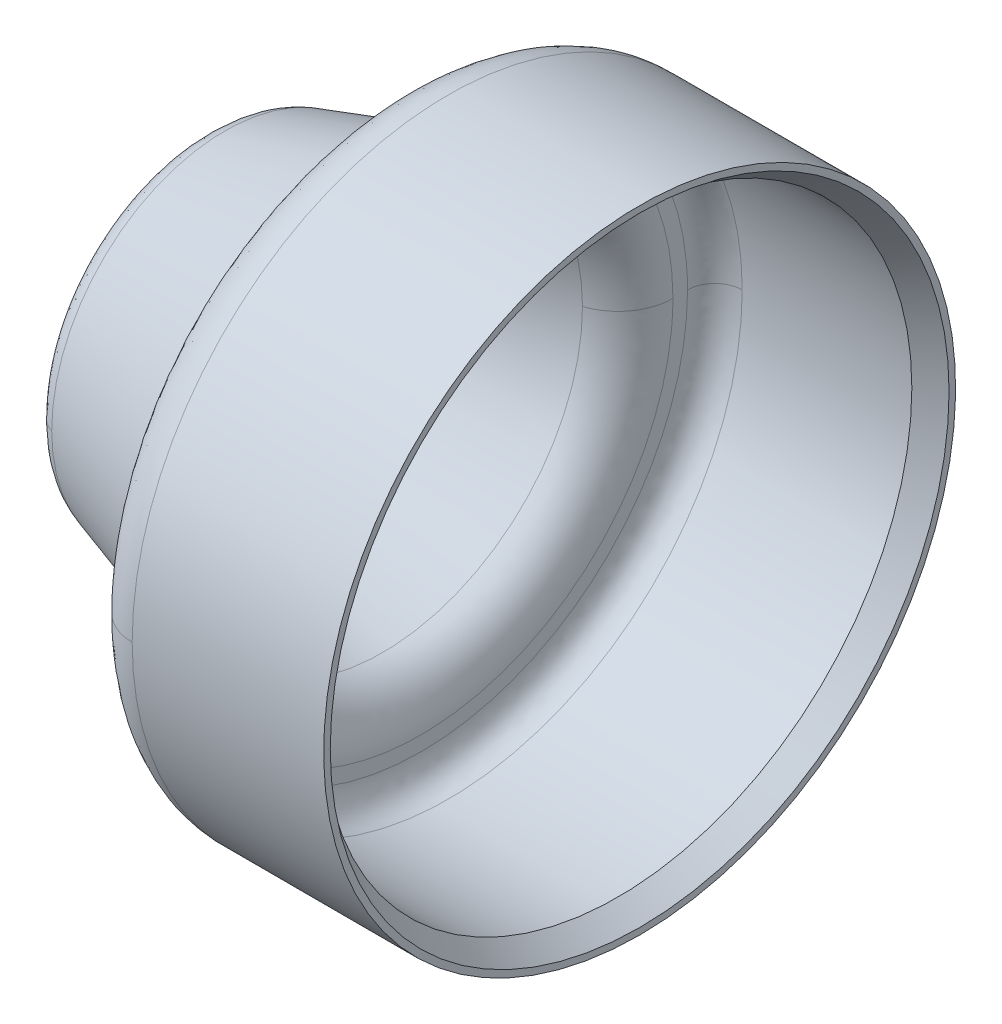
ISO-10303-21;
HEADER;
FILE_DESCRIPTION(('STEP AP214'),'2;1');
FILE_NAME('part.step','',(''),(''),'','','');
FILE_SCHEMA(('AUTOMOTIVE_DESIGN { 1 0 10303 214 1 1 1 1 }'));
ENDSEC;
DATA;
#1=APPLICATION_CONTEXT('core data for automotive mechanical design processes');
#2=APPLICATION_PROTOCOL_DEFINITION('international standard','automotive_design',2000,#1);
#3=PRODUCT_CONTEXT('',#1,'mechanical');
#4=PRODUCT('Part','Part','',(#3));
#5=PRODUCT_RELATED_PRODUCT_CATEGORY('part','',(#4));
#6=PRODUCT_DEFINITION_FORMATION('','',#4);
#7=PRODUCT_DEFINITION_CONTEXT('part definition',#1,'design');
#8=PRODUCT_DEFINITION('design','',#6,#7);
#9=PRODUCT_DEFINITION_SHAPE('','',#8);
#10=(LENGTH_UNIT() NAMED_UNIT(*) SI_UNIT(.MILLI.,.METRE.));
#11=(NAMED_UNIT(*) PLANE_ANGLE_UNIT() SI_UNIT($,.RADIAN.));
#12=(NAMED_UNIT(*) SI_UNIT($,.STERADIAN.) SOLID_ANGLE_UNIT());
#13=UNCERTAINTY_MEASURE_WITH_UNIT(LENGTH_MEASURE(1.E-05),#10,'distance_accuracy_value','');
#14=(GEOMETRIC_REPRESENTATION_CONTEXT(3) GLOBAL_UNCERTAINTY_ASSIGNED_CONTEXT((#13)) GLOBAL_UNIT_ASSIGNED_CONTEXT((#10,
#11,#12)) REPRESENTATION_CONTEXT('',''));
#15=CARTESIAN_POINT('',(0.,0.,0.));
#16=DIRECTION('',(0.,0.,1.));
#17=DIRECTION('',(1.,0.,0.));
#18=AXIS2_PLACEMENT_3D('',#15,#16,#17);
#19=CARTESIAN_POINT('',(0.,-2.624397632,2.624397632));
#20=DIRECTION('',(-1.,0.,0.));
#21=DIRECTION('',(0.,1.,0.));
#22=AXIS2_PLACEMENT_3D('',#19,#20,#21);
#23=PLANE('',#22);
#24=CARTESIAN_POINT('',(4.44899655361946E-11,0.,2.59327829228685));
#25=CARTESIAN_POINT('',(4.44899632741889E-11,5.18655658538515,2.59327829228685));
#26=CARTESIAN_POINT('',(4.44899632741889E-11,5.18655658538515,-2.59327829228685));
#27=CARTESIAN_POINT('',(4.44899655361946E-11,0.,-2.59327829228685));
#28=(BOUNDED_CURVE() B_SPLINE_CURVE(3,(#24,#25,#26,#27),.UNSPECIFIED.,.F.,
.F.) B_SPLINE_CURVE_WITH_KNOTS((4,4),(0.,1.),
.UNSPECIFIED.) CURVE() GEOMETRIC_REPRESENTATION_ITEM() RATIONAL_B_SPLINE_CURVE((0.965090916232168,
0.321696972077389,0.321696972077389,0.965090916232168)) REPRESENTATION_ITEM(''));
#29=CARTESIAN_POINT('',(2.6693979149664E-11,0.,-2.5932782918945));
#30=VERTEX_POINT('',#29);
#31=CARTESIAN_POINT('',(2.66939791828542E-11,0.,2.5932782918945));
#32=VERTEX_POINT('',#31);
#33=EDGE_CURVE('E101',#30,#32,#28,.F.);
#34=ORIENTED_EDGE('',*,*,#33,.T.);
#35=CARTESIAN_POINT('',(4.44899655361946E-11,0.,-2.59327829228685));
#36=CARTESIAN_POINT('',(4.44899632741889E-11,-5.18655658538515,-2.59327829228685));
#37=CARTESIAN_POINT('',(4.44899632741889E-11,-5.18655658538515,2.59327829228685));
#38=CARTESIAN_POINT('',(4.44899655361946E-11,0.,2.59327829228685));
#39=(BOUNDED_CURVE() B_SPLINE_CURVE(3,(#35,#36,#37,#38),.UNSPECIFIED.,.F.,
.F.) B_SPLINE_CURVE_WITH_KNOTS((4,4),(0.,1.),
.UNSPECIFIED.) CURVE() GEOMETRIC_REPRESENTATION_ITEM() RATIONAL_B_SPLINE_CURVE((0.965090916232168,
0.321696972077389,0.321696972077389,0.965090916232168)) REPRESENTATION_ITEM(''));
#40=EDGE_CURVE('E105',#32,#30,#39,.F.);
#41=ORIENTED_EDGE('',*,*,#40,.T.);
#42=EDGE_LOOP('',(#34,#41));
#43=FACE_BOUND('',#42,.T.);
#44=ADVANCED_FACE('F16',(#43),#23,.F.);
#45=CARTESIAN_POINT('',(0.000999167000000001,0.,2.573311609));
#46=CARTESIAN_POINT('',(0.000999167000000001,5.146623219,2.573311609));
#47=CARTESIAN_POINT('',(0.000999167000000001,5.146623219,-2.573311609));
#48=CARTESIAN_POINT('',(0.000999167000000001,0.,-2.573311609));
#49=CARTESIAN_POINT('',(-0.009741712,0.,2.680362131));
#50=CARTESIAN_POINT('',(-0.009741712,5.360724262,2.680362131));
#51=CARTESIAN_POINT('',(-0.009741712,5.360724262,-2.680362131));
#52=CARTESIAN_POINT('',(-0.009741712,0.,-2.680362131));
#53=CARTESIAN_POINT('',(0.053876118,0.,2.767125904));
#54=CARTESIAN_POINT('',(0.053876118,5.534251807,2.767125904));
#55=CARTESIAN_POINT('',(0.053876118,5.534251807,-2.767125904));
#56=CARTESIAN_POINT('',(0.053876118,0.,-2.767125904));
#57=CARTESIAN_POINT('',(0.15920186,0.,2.789072858));
#58=CARTESIAN_POINT('',(0.15920186,5.578145716,2.789072858));
#59=CARTESIAN_POINT('',(0.15920186,5.578145716,-2.789072858));
#60=CARTESIAN_POINT('',(0.15920186,0.,-2.789072858));
#61=(BOUNDED_SURFACE() B_SPLINE_SURFACE(3,3,((#45,#46,#47,#48),(#49,#50,#51,#52),(#53,#54,#55,
#56),(#57,#58,#59,#60)),.UNSPECIFIED.,.F.,.F.,.F.) B_SPLINE_SURFACE_WITH_KNOTS((4,4),(4,4),(0.,
1.),(0.,1.),.UNSPECIFIED.) GEOMETRIC_REPRESENTATION_ITEM() RATIONAL_B_SPLINE_SURFACE(((1.,
0.333333333333333,0.333333333333333,1.),(0.828922185213233,0.276307395071078,0.276307395071078,
0.828922185213233),(0.828922185213233,0.276307395071078,0.276307395071078,0.828922185213233),
(1.,0.333333333333333,0.333333333333333,1.))) REPRESENTATION_ITEM('') SURFACE());
#62=CARTESIAN_POINT('',(0.139858840000007,0.,0.));
#63=DIRECTION('',(1.,0.,0.));
#64=DIRECTION('',(0.,0.,-1.));
#65=AXIS2_PLACEMENT_3D('',#62,#63,#64);
#66=CIRCLE('',#65,2.784021683);
#67=CARTESIAN_POINT('',(0.139858840054538,-8.56518588366484E-10,2.78402168300261));
#68=VERTEX_POINT('',#67);
#69=CARTESIAN_POINT('',(0.139858840054538,-3.74981112811257E-10,-2.78402168300262));
#70=VERTEX_POINT('',#69);
#71=EDGE_CURVE('E125',#68,#70,#66,.F.);
#72=CARTESIAN_POINT('',(0.000999167000000001,0.,2.573311609));
#73=CARTESIAN_POINT('',(-0.009741712,0.,2.680362131));
#74=CARTESIAN_POINT('',(0.053876118,0.,2.767125904));
#75=CARTESIAN_POINT('',(0.15920186,0.,2.789072858));
#76=(BOUNDED_CURVE() B_SPLINE_CURVE(3,(#72,#73,#74,#75),.UNSPECIFIED.,.F.,
.F.) B_SPLINE_CURVE_WITH_KNOTS((4,4),(0.,1.),
.UNSPECIFIED.) CURVE() GEOMETRIC_REPRESENTATION_ITEM() RATIONAL_B_SPLINE_CURVE((1.,
0.828922185213233,0.828922185213233,1.)) REPRESENTATION_ITEM(''));
#77=EDGE_CURVE('E112',#68,#32,#76,.F.);
#78=CARTESIAN_POINT('',(0.000999167000000001,0.,-2.573311609));
#79=CARTESIAN_POINT('',(-0.009741712,0.,-2.680362131));
#80=CARTESIAN_POINT('',(0.053876118,0.,-2.767125904));
#81=CARTESIAN_POINT('',(0.15920186,0.,-2.789072858));
#82=(BOUNDED_CURVE() B_SPLINE_CURVE(3,(#78,#79,#80,#81),.UNSPECIFIED.,.F.,
.F.) B_SPLINE_CURVE_WITH_KNOTS((4,4),(0.,1.),
.UNSPECIFIED.) CURVE() GEOMETRIC_REPRESENTATION_ITEM() RATIONAL_B_SPLINE_CURVE((1.,
0.828922185213233,0.828922185213233,1.)) REPRESENTATION_ITEM(''));
#83=EDGE_CURVE('E111',#30,#70,#82,.T.);
#84=ORIENTED_EDGE('',*,*,#71,.F.);
#85=ORIENTED_EDGE('',*,*,#77,.T.);
#86=ORIENTED_EDGE('',*,*,#33,.F.);
#87=ORIENTED_EDGE('',*,*,#83,.T.);
#88=EDGE_LOOP('',(#84,#85,#86,#87));
#89=FACE_BOUND('',#88,.T.);
#90=ADVANCED_FACE('F117',(#89),#61,.F.);
#91=CARTESIAN_POINT('',(0.000999167000000001,0.,-2.573311609));
#92=CARTESIAN_POINT('',(0.000999167000000001,-5.146623219,-2.573311609));
#93=CARTESIAN_POINT('',(0.000999167000000001,-5.146623219,2.573311609));
#94=CARTESIAN_POINT('',(0.000999167000000001,0.,2.573311609));
#95=CARTESIAN_POINT('',(-0.009741712,0.,-2.680362131));
#96=CARTESIAN_POINT('',(-0.009741712,-5.360724262,-2.680362131));
#97=CARTESIAN_POINT('',(-0.009741712,-5.360724262,2.680362131));
#98=CARTESIAN_POINT('',(-0.009741712,0.,2.680362131));
#99=CARTESIAN_POINT('',(0.053876118,0.,-2.767125904));
#100=CARTESIAN_POINT('',(0.053876118,-5.534251807,-2.767125904));
#101=CARTESIAN_POINT('',(0.053876118,-5.534251807,2.767125904));
#102=CARTESIAN_POINT('',(0.053876118,0.,2.767125904));
#103=CARTESIAN_POINT('',(0.15920186,0.,-2.789072858));
#104=CARTESIAN_POINT('',(0.15920186,-5.578145716,-2.789072858));
#105=CARTESIAN_POINT('',(0.15920186,-5.578145716,2.789072858));
#106=CARTESIAN_POINT('',(0.15920186,0.,2.789072858));
#107=(BOUNDED_SURFACE() B_SPLINE_SURFACE(3,3,((#91,#92,#93,#94),(#95,#96,#97,#98),(#99,#100,
#101,#102),(#103,#104,#105,#106)),.UNSPECIFIED.,.F.,.F.,.F.) B_SPLINE_SURFACE_WITH_KNOTS((4,4),
(4,4),(0.,1.),(0.,1.),
.UNSPECIFIED.) GEOMETRIC_REPRESENTATION_ITEM() RATIONAL_B_SPLINE_SURFACE(((1.,0.333333333333333,
0.333333333333333,1.),(0.828922185213233,0.276307395071078,0.276307395071078,0.828922185213233),
(0.828922185213233,0.276307395071078,0.276307395071078,0.828922185213233),(1.,0.333333333333333,
0.333333333333333,1.))) REPRESENTATION_ITEM('') SURFACE());
#108=CARTESIAN_POINT('',(0.139858840000007,0.,0.));
#109=DIRECTION('',(1.,0.,0.));
#110=DIRECTION('',(0.,0.,-1.));
#111=AXIS2_PLACEMENT_3D('',#108,#109,#110);
#112=CIRCLE('',#111,2.784021683);
#113=EDGE_CURVE('E123',#70,#68,#112,.F.);
#114=ORIENTED_EDGE('',*,*,#83,.F.);
#115=ORIENTED_EDGE('',*,*,#40,.F.);
#116=ORIENTED_EDGE('',*,*,#77,.F.);
#117=ORIENTED_EDGE('',*,*,#113,.F.);
#118=EDGE_LOOP('',(#114,#115,#116,#117));
#119=FACE_BOUND('',#118,.T.);
#120=ADVANCED_FACE('F121',(#119),#107,.F.);
#121=CARTESIAN_POINT('',(0.13985884,0.,0.));
#122=DIRECTION('',(1.,0.,0.));
#123=DIRECTION('',(0.,0.,-1.));
#124=AXIS2_PLACEMENT_3D('',#121,#122,#123);
#125=CONICAL_SURFACE('',#124,2.784021683,0.305432619175368);
#126=CARTESIAN_POINT('',(2.90070579940886,0.,0.));
#127=DIRECTION('',(-1.,0.,0.));
#128=DIRECTION('',(0.,-1.,0.));
#129=AXIS2_PLACEMENT_3D('',#126,#127,#128);
#130=CIRCLE('',#129,3.65451338528454);
#131=CARTESIAN_POINT('',(2.90070579955662,-3.74776612511883E-10,3.6545133854634));
#132=VERTEX_POINT('',#131);
#133=CARTESIAN_POINT('',(2.90070579937093,-1.64076008524642E-10,-3.65451338540485));
#134=VERTEX_POINT('',#133);
#135=EDGE_CURVE('E567',#132,#134,#130,.T.);
#136=ORIENTED_EDGE('',*,*,#135,.F.);
#137=CARTESIAN_POINT('',(2.90070579940886,0.,0.));
#138=DIRECTION('',(-1.,0.,0.));
#139=DIRECTION('',(0.,-1.,0.));
#140=AXIS2_PLACEMENT_3D('',#137,#138,#139);
#141=CIRCLE('',#140,3.65451338528454);
#142=EDGE_CURVE('E577',#134,#132,#141,.T.);
#143=ORIENTED_EDGE('',*,*,#142,.F.);
#144=EDGE_LOOP('',(#136,#143));
#145=FACE_BOUND('',#144,.T.);
#146=ORIENTED_EDGE('',*,*,#113,.T.);
#147=ORIENTED_EDGE('',*,*,#71,.T.);
#148=EDGE_LOOP('',(#146,#147));
#149=FACE_BOUND('',#148,.T.);
#150=ADVANCED_FACE('F160',(#145,#149),#125,.F.);
#151=CARTESIAN_POINT('',(-0.4,-2.624397632,2.624397632));
#152=DIRECTION('',(-1.,0.,0.));
#153=DIRECTION('',(0.,1.,0.));
#154=AXIS2_PLACEMENT_3D('',#151,#152,#153);
#155=PLANE('',#154);
#156=CARTESIAN_POINT('',(-0.399999999854075,0.,2.59327829310577));
#157=CARTESIAN_POINT('',(-0.399999999854075,-5.18655658622481,2.59327829310577));
#158=CARTESIAN_POINT('',(-0.399999999854075,-5.18655658622481,-2.59327829310577));
#159=CARTESIAN_POINT('',(-0.399999999854075,0.,-2.59327829310577));
#160=(BOUNDED_CURVE() B_SPLINE_CURVE(3,(#156,#157,#158,#159),.UNSPECIFIED.,.F.,
.F.) B_SPLINE_CURVE_WITH_KNOTS((4,4),(0.,1.),
.UNSPECIFIED.) CURVE() GEOMETRIC_REPRESENTATION_ITEM() RATIONAL_B_SPLINE_CURVE((0.965090915911284,
0.321696971970428,0.321696971970428,0.965090915911284)) REPRESENTATION_ITEM(''));
#161=CARTESIAN_POINT('',(-0.399999999912445,0.,2.59327829234567));
#162=VERTEX_POINT('',#161);
#163=CARTESIAN_POINT('',(-0.399999999912445,0.,-2.59327829234567));
#164=VERTEX_POINT('',#163);
#165=EDGE_CURVE('E209',#162,#164,#160,.T.);
#166=ORIENTED_EDGE('',*,*,#165,.F.);
#167=CARTESIAN_POINT('',(-0.399999999854075,0.,-2.59327829310576));
#168=CARTESIAN_POINT('',(-0.399999999854075,5.18655658622481,-2.59327829310576));
#169=CARTESIAN_POINT('',(-0.399999999854075,5.18655658622481,2.59327829310576));
#170=CARTESIAN_POINT('',(-0.399999999854075,0.,2.59327829310576));
#171=(BOUNDED_CURVE() B_SPLINE_CURVE(3,(#167,#168,#169,#170),.UNSPECIFIED.,.F.,
.F.) B_SPLINE_CURVE_WITH_KNOTS((4,4),(0.,1.),
.UNSPECIFIED.) CURVE() GEOMETRIC_REPRESENTATION_ITEM() RATIONAL_B_SPLINE_CURVE((0.965090915911282,
0.321696971970427,0.321696971970427,0.965090915911282)) REPRESENTATION_ITEM(''));
#172=EDGE_CURVE('E221',#164,#162,#171,.T.);
#173=ORIENTED_EDGE('',*,*,#172,.F.);
#174=EDGE_LOOP('',(#166,#173));
#175=FACE_BOUND('',#174,.T.);
#176=ADVANCED_FACE('F194',(#175),#155,.T.);
#177=CARTESIAN_POINT('',(3.595004165,0.,4.708063753));
#178=CARTESIAN_POINT('',(3.595004165,9.416127506,4.708063753));
#179=CARTESIAN_POINT('',(3.595004165,9.416127506,-4.708063753));
#180=CARTESIAN_POINT('',(3.595004165,0.,-4.708063753));
#181=CARTESIAN_POINT('',(3.64870856,0.,4.172811146));
#182=CARTESIAN_POINT('',(3.64870856,8.345622292,4.172811146));
#183=CARTESIAN_POINT('',(3.64870856,8.345622292,-4.172811146));
#184=CARTESIAN_POINT('',(3.64870856,0.,-4.172811146));
#185=CARTESIAN_POINT('',(3.330619408,0.,3.738992282));
#186=CARTESIAN_POINT('',(3.330619408,7.477984564,3.738992282));
#187=CARTESIAN_POINT('',(3.330619408,7.477984564,-3.738992282));
#188=CARTESIAN_POINT('',(3.330619408,0.,-3.738992282));
#189=CARTESIAN_POINT('',(2.803990701,0.,3.62925751));
#190=CARTESIAN_POINT('',(2.803990701,7.258515021,3.62925751));
#191=CARTESIAN_POINT('',(2.803990701,7.258515021,-3.62925751));
#192=CARTESIAN_POINT('',(2.803990701,0.,-3.62925751));
#193=(BOUNDED_SURFACE() B_SPLINE_SURFACE(3,3,((#177,#178,#179,#180),(#181,#182,#183,#184),(#185,
#186,#187,#188),(#189,#190,#191,#192)),.UNSPECIFIED.,.F.,.F.,
.F.) B_SPLINE_SURFACE_WITH_KNOTS((4,4),(4,4),(0.,1.),(0.,1.),
.UNSPECIFIED.) GEOMETRIC_REPRESENTATION_ITEM() RATIONAL_B_SPLINE_SURFACE(((1.,0.333333333333333,
0.333333333333333,1.),(0.828922185213162,0.276307395071054,0.276307395071054,0.828922185213162),
(0.828922185213162,0.276307395071054,0.276307395071054,0.828922185213162),(1.,0.333333333333333,
0.333333333333333,1.))) REPRESENTATION_ITEM('') SURFACE());
#194=CARTESIAN_POINT('',(3.59999999975223,0.,-4.60823033608385));
#195=CARTESIAN_POINT('',(3.59999999975223,9.21646067216811,-4.60823033608385));
#196=CARTESIAN_POINT('',(3.59999999975223,9.21646067216811,4.60823033608385));
#197=CARTESIAN_POINT('',(3.59999999975223,0.,4.60823033608385));
#198=(BOUNDED_CURVE() B_SPLINE_CURVE(3,(#194,#195,#196,#197),.UNSPECIFIED.,.F.,
.F.) B_SPLINE_CURVE_WITH_KNOTS((4,4),(0.,1.),
.UNSPECIFIED.) CURVE() GEOMETRIC_REPRESENTATION_ITEM() RATIONAL_B_SPLINE_CURVE((0.965090915909486,
0.321696971969828,0.321696971969828,0.965090915909486)) REPRESENTATION_ITEM(''));
#199=CARTESIAN_POINT('',(3.59999999985134,0.,-4.60823033724953));
#200=VERTEX_POINT('',#199);
#201=CARTESIAN_POINT('',(3.59999999985134,0.,4.60823033724953));
#202=VERTEX_POINT('',#201);
#203=EDGE_CURVE('E235',#200,#202,#198,.T.);
#204=CARTESIAN_POINT('',(3.595004165,0.,4.708063753));
#205=CARTESIAN_POINT('',(3.64870856,0.,4.172811146));
#206=CARTESIAN_POINT('',(3.330619408,0.,3.738992282));
#207=CARTESIAN_POINT('',(2.803990701,0.,3.62925751));
#208=(BOUNDED_CURVE() B_SPLINE_CURVE(3,(#204,#205,#206,#207),.UNSPECIFIED.,.F.,
.F.) B_SPLINE_CURVE_WITH_KNOTS((4,4),(0.,1.),
.UNSPECIFIED.) CURVE() GEOMETRIC_REPRESENTATION_ITEM() RATIONAL_B_SPLINE_CURVE((1.,
0.828922185213183,0.828922185213183,1.)) REPRESENTATION_ITEM(''));
#209=EDGE_CURVE('E580',#132,#202,#208,.F.);
#210=CARTESIAN_POINT('',(3.595004165,0.,-4.708063753));
#211=CARTESIAN_POINT('',(3.64870856,0.,-4.172811146));
#212=CARTESIAN_POINT('',(3.330619408,0.,-3.738992282));
#213=CARTESIAN_POINT('',(2.803990701,0.,-3.62925751));
#214=(BOUNDED_CURVE() B_SPLINE_CURVE(3,(#210,#211,#212,#213),.UNSPECIFIED.,.F.,
.F.) B_SPLINE_CURVE_WITH_KNOTS((4,4),(0.,1.),
.UNSPECIFIED.) CURVE() GEOMETRIC_REPRESENTATION_ITEM() RATIONAL_B_SPLINE_CURVE((1.,
0.828922185213183,0.828922185213183,1.)) REPRESENTATION_ITEM(''));
#215=EDGE_CURVE('E574',#200,#134,#214,.T.);
#216=ORIENTED_EDGE('',*,*,#203,.T.);
#217=ORIENTED_EDGE('',*,*,#209,.F.);
#218=ORIENTED_EDGE('',*,*,#135,.T.);
#219=ORIENTED_EDGE('',*,*,#215,.F.);
#220=EDGE_LOOP('',(#216,#217,#218,#219));
#221=FACE_BOUND('',#220,.T.);
#222=ADVANCED_FACE('F591',(#221),#193,.T.);
#223=CARTESIAN_POINT('',(3.595004165,0.,-4.708063753));
#224=CARTESIAN_POINT('',(3.595004165,-9.416127506,-4.708063753));
#225=CARTESIAN_POINT('',(3.595004165,-9.416127506,4.708063753));
#226=CARTESIAN_POINT('',(3.595004165,0.,4.708063753));
#227=CARTESIAN_POINT('',(3.64870856,0.,-4.172811146));
#228=CARTESIAN_POINT('',(3.64870856,-8.345622292,-4.172811146));
#229=CARTESIAN_POINT('',(3.64870856,-8.345622292,4.172811146));
#230=CARTESIAN_POINT('',(3.64870856,0.,4.172811146));
#231=CARTESIAN_POINT('',(3.330619408,0.,-3.738992282));
#232=CARTESIAN_POINT('',(3.330619408,-7.477984564,-3.738992282));
#233=CARTESIAN_POINT('',(3.330619408,-7.477984564,3.738992282));
#234=CARTESIAN_POINT('',(3.330619408,0.,3.738992282));
#235=CARTESIAN_POINT('',(2.803990701,0.,-3.62925751));
#236=CARTESIAN_POINT('',(2.803990701,-7.258515021,-3.62925751));
#237=CARTESIAN_POINT('',(2.803990701,-7.258515021,3.62925751));
#238=CARTESIAN_POINT('',(2.803990701,0.,3.62925751));
#239=(BOUNDED_SURFACE() B_SPLINE_SURFACE(3,3,((#223,#224,#225,#226),(#227,#228,#229,#230),(#231,
#232,#233,#234),(#235,#236,#237,#238)),.UNSPECIFIED.,.F.,.F.,
.F.) B_SPLINE_SURFACE_WITH_KNOTS((4,4),(4,4),(0.,1.),(0.,1.),
.UNSPECIFIED.) GEOMETRIC_REPRESENTATION_ITEM() RATIONAL_B_SPLINE_SURFACE(((1.,0.333333333333333,
0.333333333333333,1.),(0.828922185213183,0.276307395071061,0.276307395071061,0.828922185213183),
(0.828922185213183,0.276307395071061,0.276307395071061,0.828922185213183),(1.,0.333333333333333,
0.333333333333333,1.))) REPRESENTATION_ITEM('') SURFACE());
#240=CARTESIAN_POINT('',(3.59999999975223,0.,4.60823033608385));
#241=CARTESIAN_POINT('',(3.59999999975223,-9.2164606721681,4.60823033608385));
#242=CARTESIAN_POINT('',(3.59999999975223,-9.2164606721681,-4.60823033608385));
#243=CARTESIAN_POINT('',(3.59999999975223,0.,-4.60823033608385));
#244=(BOUNDED_CURVE() B_SPLINE_CURVE(3,(#240,#241,#242,#243),.UNSPECIFIED.,.F.,
.F.) B_SPLINE_CURVE_WITH_KNOTS((4,4),(0.,1.),
.UNSPECIFIED.) CURVE() GEOMETRIC_REPRESENTATION_ITEM() RATIONAL_B_SPLINE_CURVE((0.96509091590949,
0.32169697196983,0.32169697196983,0.96509091590949)) REPRESENTATION_ITEM(''));
#245=EDGE_CURVE('E801',#202,#200,#244,.T.);
#246=ORIENTED_EDGE('',*,*,#209,.T.);
#247=ORIENTED_EDGE('',*,*,#245,.T.);
#248=ORIENTED_EDGE('',*,*,#215,.T.);
#249=ORIENTED_EDGE('',*,*,#142,.T.);
#250=EDGE_LOOP('',(#246,#247,#248,#249));
#251=FACE_BOUND('',#250,.T.);
#252=ADVANCED_FACE('F669',(#251),#239,.T.);
#253=CARTESIAN_POINT('',(-0.397002499,0.,-2.533378243));
#254=CARTESIAN_POINT('',(-0.397002499,-5.066756486,-2.533378243));
#255=CARTESIAN_POINT('',(-0.397002499,-5.066756486,2.533378243));
#256=CARTESIAN_POINT('',(-0.397002499,0.,2.533378243));
#257=CARTESIAN_POINT('',(-0.429225136,0.,-2.854529807));
#258=CARTESIAN_POINT('',(-0.429225136,-5.709059614,-2.854529807));
#259=CARTESIAN_POINT('',(-0.429225136,-5.709059614,2.854529807));
#260=CARTESIAN_POINT('',(-0.429225136,0.,2.854529807));
#261=CARTESIAN_POINT('',(-0.238371645,0.,-3.114821125));
#262=CARTESIAN_POINT('',(-0.238371645,-6.229642251,-3.114821125));
#263=CARTESIAN_POINT('',(-0.238371645,-6.229642251,3.114821125));
#264=CARTESIAN_POINT('',(-0.238371645,0.,3.114821125));
#265=CARTESIAN_POINT('',(0.077605579,0.,-3.180661988));
#266=CARTESIAN_POINT('',(0.077605579,-6.361323977,-3.180661988));
#267=CARTESIAN_POINT('',(0.077605579,-6.361323977,3.180661988));
#268=CARTESIAN_POINT('',(0.077605579,0.,3.180661988));
#269=(BOUNDED_SURFACE() B_SPLINE_SURFACE(3,3,((#253,#254,#255,#256),(#257,#258,#259,#260),(#261,
#262,#263,#264),(#265,#266,#267,#268)),.UNSPECIFIED.,.F.,.F.,
.F.) B_SPLINE_SURFACE_WITH_KNOTS((4,4),(4,4),(0.,1.),(0.,1.),
.UNSPECIFIED.) GEOMETRIC_REPRESENTATION_ITEM() RATIONAL_B_SPLINE_SURFACE(((1.,0.333333333333333,
0.333333333333333,1.),(0.828922185213199,0.276307395071066,0.276307395071066,0.828922185213199),
(0.828922185213199,0.276307395071066,0.276307395071066,0.828922185213199),(1.,0.333333333333333,
0.333333333333333,1.))) REPRESENTATION_ITEM('') SURFACE());
#270=CARTESIAN_POINT('',(-0.397002499,0.,2.533378243));
#271=CARTESIAN_POINT('',(-0.429225136,0.,2.854529807));
#272=CARTESIAN_POINT('',(-0.238371645,0.,3.114821125));
#273=CARTESIAN_POINT('',(0.077605579,0.,3.180661988));
#274=(BOUNDED_CURVE() B_SPLINE_CURVE(3,(#270,#271,#272,#273),.UNSPECIFIED.,.F.,
.F.) B_SPLINE_CURVE_WITH_KNOTS((4,4),(0.,1.),
.UNSPECIFIED.) CURVE() GEOMETRIC_REPRESENTATION_ITEM() RATIONAL_B_SPLINE_CURVE((1.,
0.828922185213185,0.828922185213185,1.)) REPRESENTATION_ITEM(''));
#275=CARTESIAN_POINT('',(0.0195765200091177,-9.73884958133393E-10,3.16550846297093));
#276=VERTEX_POINT('',#275);
#277=EDGE_CURVE('E820',#162,#276,#274,.T.);
#278=CARTESIAN_POINT('',(-0.397002499,0.,-2.533378243));
#279=CARTESIAN_POINT('',(-0.429225136,0.,-2.854529807));
#280=CARTESIAN_POINT('',(-0.238371645,0.,-3.114821125));
#281=CARTESIAN_POINT('',(0.077605579,0.,-3.180661988));
#282=(BOUNDED_CURVE() B_SPLINE_CURVE(3,(#278,#279,#280,#281),.UNSPECIFIED.,.F.,
.F.) B_SPLINE_CURVE_WITH_KNOTS((4,4),(0.,1.),
.UNSPECIFIED.) CURVE() GEOMETRIC_REPRESENTATION_ITEM() RATIONAL_B_SPLINE_CURVE((1.,
0.828922185213185,0.828922185213185,1.)) REPRESENTATION_ITEM(''));
#283=CARTESIAN_POINT('',(0.0195765200091183,-1.42121245357316E-10,-3.16550846297093));
#284=VERTEX_POINT('',#283);
#285=EDGE_CURVE('E806',#284,#164,#282,.F.);
#286=CARTESIAN_POINT('',(0.0195765199999531,0.,0.));
#287=DIRECTION('',(1.,0.,0.));
#288=DIRECTION('',(0.,0.,-1.));
#289=AXIS2_PLACEMENT_3D('',#286,#287,#288);
#290=CIRCLE('',#289,3.165508463);
#291=EDGE_CURVE('E514',#284,#276,#290,.F.);
#292=ORIENTED_EDGE('',*,*,#277,.F.);
#293=ORIENTED_EDGE('',*,*,#165,.T.);
#294=ORIENTED_EDGE('',*,*,#285,.F.);
#295=ORIENTED_EDGE('',*,*,#291,.T.);
#296=EDGE_LOOP('',(#292,#293,#294,#295));
#297=FACE_BOUND('',#296,.T.);
#298=ADVANCED_FACE('F540',(#297),#269,.T.);
#299=CARTESIAN_POINT('',(-0.397002499,0.,2.533378243));
#300=CARTESIAN_POINT('',(-0.397002499,5.066756486,2.533378243));
#301=CARTESIAN_POINT('',(-0.397002499,5.066756486,-2.533378243));
#302=CARTESIAN_POINT('',(-0.397002499,0.,-2.533378243));
#303=CARTESIAN_POINT('',(-0.429225136,0.,2.854529807));
#304=CARTESIAN_POINT('',(-0.429225136,5.709059614,2.854529807));
#305=CARTESIAN_POINT('',(-0.429225136,5.709059614,-2.854529807));
#306=CARTESIAN_POINT('',(-0.429225136,0.,-2.854529807));
#307=CARTESIAN_POINT('',(-0.238371645,0.,3.114821125));
#308=CARTESIAN_POINT('',(-0.238371645,6.229642251,3.114821125));
#309=CARTESIAN_POINT('',(-0.238371645,6.229642251,-3.114821125));
#310=CARTESIAN_POINT('',(-0.238371645,0.,-3.114821125));
#311=CARTESIAN_POINT('',(0.077605579,0.,3.180661988));
#312=CARTESIAN_POINT('',(0.077605579,6.361323977,3.180661988));
#313=CARTESIAN_POINT('',(0.077605579,6.361323977,-3.180661988));
#314=CARTESIAN_POINT('',(0.077605579,0.,-3.180661988));
#315=(BOUNDED_SURFACE() B_SPLINE_SURFACE(3,3,((#299,#300,#301,#302),(#303,#304,#305,#306),(#307,
#308,#309,#310),(#311,#312,#313,#314)),.UNSPECIFIED.,.F.,.F.,
.F.) B_SPLINE_SURFACE_WITH_KNOTS((4,4),(4,4),(0.,1.),(0.,1.),
.UNSPECIFIED.) GEOMETRIC_REPRESENTATION_ITEM() RATIONAL_B_SPLINE_SURFACE(((1.,0.333333333333333,
0.333333333333333,1.),(0.828922185213185,0.276307395071062,0.276307395071062,0.828922185213185),
(0.828922185213185,0.276307395071062,0.276307395071062,0.828922185213185),(1.,0.333333333333333,
0.333333333333333,1.))) REPRESENTATION_ITEM('') SURFACE());
#316=CARTESIAN_POINT('',(0.0195765199999531,0.,0.));
#317=DIRECTION('',(1.,0.,0.));
#318=DIRECTION('',(0.,0.,-1.));
#319=AXIS2_PLACEMENT_3D('',#316,#317,#318);
#320=CIRCLE('',#319,3.165508463);
#321=EDGE_CURVE('E813',#276,#284,#320,.F.);
#322=ORIENTED_EDGE('',*,*,#172,.T.);
#323=ORIENTED_EDGE('',*,*,#277,.T.);
#324=ORIENTED_EDGE('',*,*,#321,.T.);
#325=ORIENTED_EDGE('',*,*,#285,.T.);
#326=EDGE_LOOP('',(#322,#323,#324,#325));
#327=FACE_BOUND('',#326,.T.);
#328=ADVANCED_FACE('F249',(#327),#315,.T.);
#329=CARTESIAN_POINT('',(3.6,-4.9335,4.9335));
#330=DIRECTION('',(-1.,0.,0.));
#331=DIRECTION('',(0.,1.,0.));
#332=AXIS2_PLACEMENT_3D('',#329,#330,#331);
#333=PLANE('',#332);
#334=ORIENTED_EDGE('',*,*,#203,.F.);
#335=ORIENTED_EDGE('',*,*,#245,.F.);
#336=EDGE_LOOP('',(#334,#335));
#337=FACE_BOUND('',#336,.T.);
#338=CARTESIAN_POINT('',(3.5999999997338,0.,4.87500000080508));
#339=CARTESIAN_POINT('',(3.5999999997338,9.75000000062785,4.87500000080508));
#340=CARTESIAN_POINT('',(3.5999999997338,9.75000000062785,-4.87500000080508));
#341=CARTESIAN_POINT('',(3.5999999997338,0.,-4.87500000080508));
#342=(BOUNDED_CURVE() B_SPLINE_CURVE(3,(#338,#339,#340,#341),.UNSPECIFIED.,.F.,
.F.) B_SPLINE_CURVE_WITH_KNOTS((4,4),(0.,1.),
.UNSPECIFIED.) CURVE() GEOMETRIC_REPRESENTATION_ITEM() RATIONAL_B_SPLINE_CURVE((0.956578301970017,
0.318859433990005,0.318859433990005,0.956578301970017)) REPRESENTATION_ITEM(''));
#343=CARTESIAN_POINT('',(3.59999999984028,0.,-4.87499999946638));
#344=VERTEX_POINT('',#343);
#345=CARTESIAN_POINT('',(3.59999999984028,0.,4.87499999946638));
#346=VERTEX_POINT('',#345);
#347=EDGE_CURVE('E471',#344,#346,#342,.F.);
#348=ORIENTED_EDGE('',*,*,#347,.T.);
#349=CARTESIAN_POINT('',(3.59999999973381,0.,-4.87500000080508));
#350=CARTESIAN_POINT('',(3.59999999973381,-9.75000000062785,-4.87500000080508));
#351=CARTESIAN_POINT('',(3.59999999973381,-9.75000000062785,4.87500000080508));
#352=CARTESIAN_POINT('',(3.59999999973381,0.,4.87500000080508));
#353=(BOUNDED_CURVE() B_SPLINE_CURVE(3,(#349,#350,#351,#352),.UNSPECIFIED.,.F.,
.F.) B_SPLINE_CURVE_WITH_KNOTS((4,4),(0.,1.),
.UNSPECIFIED.) CURVE() GEOMETRIC_REPRESENTATION_ITEM() RATIONAL_B_SPLINE_CURVE((0.956578301970017,
0.318859433990005,0.318859433990005,0.956578301970017)) REPRESENTATION_ITEM(''));
#354=EDGE_CURVE('E270',#346,#344,#353,.F.);
#355=ORIENTED_EDGE('',*,*,#354,.T.);
#356=EDGE_LOOP('',(#348,#355));
#357=FACE_BOUND('',#356,.T.);
#358=ADVANCED_FACE('F240',(#337,#357),#333,.F.);
#359=CARTESIAN_POINT('',(0.01957652,0.,0.));
#360=DIRECTION('',(1.,0.,0.));
#361=DIRECTION('',(0.,0.,-1.));
#362=AXIS2_PLACEMENT_3D('',#359,#360,#361);
#363=CONICAL_SURFACE('',#362,3.165508463,0.305432619175368);
#364=CARTESIAN_POINT('',(2.78042348000752,0.,0.));
#365=DIRECTION('',(-1.,0.,0.));
#366=DIRECTION('',(0.,-1.,0.));
#367=AXIS2_PLACEMENT_3D('',#364,#365,#366);
#368=CIRCLE('',#367,4.0360001661302);
#369=CARTESIAN_POINT('',(2.78042348001669,-4.13898735768951E-10,4.03600016610113));
#370=VERTEX_POINT('',#369);
#371=CARTESIAN_POINT('',(2.78042348000566,0.,-4.03600016609765));
#372=VERTEX_POINT('',#371);
#373=EDGE_CURVE('E492',#370,#372,#368,.T.);
#374=ORIENTED_EDGE('',*,*,#373,.T.);
#375=CARTESIAN_POINT('',(2.78042348000753,0.,0.));
#376=DIRECTION('',(-1.,0.,0.));
#377=DIRECTION('',(0.,-1.,0.));
#378=AXIS2_PLACEMENT_3D('',#375,#376,#377);
#379=CIRCLE('',#378,4.0360001661302);
#380=EDGE_CURVE('E480',#372,#370,#379,.T.);
#381=ORIENTED_EDGE('',*,*,#380,.T.);
#382=EDGE_LOOP('',(#374,#381));
#383=FACE_BOUND('',#382,.T.);
#384=ORIENTED_EDGE('',*,*,#321,.F.);
#385=ORIENTED_EDGE('',*,*,#291,.F.);
#386=EDGE_LOOP('',(#384,#385));
#387=FACE_BOUND('',#386,.T.);
#388=ADVANCED_FACE('F248',(#383,#387),#363,.T.);
#389=CARTESIAN_POINT('',(3.602497917,0.,-4.825083292));
#390=CARTESIAN_POINT('',(3.602497917,-9.650166583,-4.825083292));
#391=CARTESIAN_POINT('',(3.602497917,-9.650166583,4.825083292));
#392=CARTESIAN_POINT('',(3.602497917,0.,4.825083292));
#393=CARTESIAN_POINT('',(3.568389789,0.,-5.165026883));
#394=CARTESIAN_POINT('',(3.568389789,-10.330053765,-5.165026883));
#395=CARTESIAN_POINT('',(3.568389789,-10.330053765,5.165026883));
#396=CARTESIAN_POINT('',(3.568389789,0.,5.165026883));
#397=CARTESIAN_POINT('',(3.809973117,0.,-5.406610211));
#398=CARTESIAN_POINT('',(3.809973117,-10.813220423,-5.406610211));
#399=CARTESIAN_POINT('',(3.809973117,-10.813220423,5.406610211));
#400=CARTESIAN_POINT('',(3.809973117,0.,5.406610211));
#401=CARTESIAN_POINT('',(4.149916708,0.,-5.372502083));
#402=CARTESIAN_POINT('',(4.149916708,-10.745004165,-5.372502083));
#403=CARTESIAN_POINT('',(4.149916708,-10.745004165,5.372502083));
#404=CARTESIAN_POINT('',(4.149916708,0.,5.372502083));
#405=(BOUNDED_SURFACE() B_SPLINE_SURFACE(3,3,((#389,#390,#391,#392),(#393,#394,#395,#396),(#397,
#398,#399,#400),(#401,#402,#403,#404)),.UNSPECIFIED.,.F.,.F.,
.F.) B_SPLINE_SURFACE_WITH_KNOTS((4,4),(4,4),(0.,1.),(0.,1.),
.UNSPECIFIED.) GEOMETRIC_REPRESENTATION_ITEM() RATIONAL_B_SPLINE_SURFACE(((1.,0.333333333333333,
0.333333333333333,1.),(0.755320871118091,0.25177362370603,0.25177362370603,0.755320871118091),
(0.755320871118091,0.25177362370603,0.25177362370603,0.755320871118091),(1.,0.333333333333333,
0.333333333333333,1.))) REPRESENTATION_ITEM('') SURFACE());
#406=CARTESIAN_POINT('',(3.602497917,0.,-4.825083292));
#407=CARTESIAN_POINT('',(3.568389789,0.,-5.165026883));
#408=CARTESIAN_POINT('',(3.809973117,0.,-5.406610211));
#409=CARTESIAN_POINT('',(4.149916708,0.,-5.372502083));
#410=(BOUNDED_CURVE() B_SPLINE_CURVE(3,(#406,#407,#408,#409),.UNSPECIFIED.,.F.,
.F.) B_SPLINE_CURVE_WITH_KNOTS((4,4),(0.,1.),
.UNSPECIFIED.) CURVE() GEOMETRIC_REPRESENTATION_ITEM() RATIONAL_B_SPLINE_CURVE((1.,
0.755320871118091,0.755320871118091,1.)) REPRESENTATION_ITEM(''));
#411=CARTESIAN_POINT('',(4.1,-1.37803866033056E-09,-5.37500000006655));
#412=VERTEX_POINT('',#411);
#413=EDGE_CURVE('E470',#412,#344,#410,.F.);
#414=CARTESIAN_POINT('',(3.602497917,0.,4.825083292));
#415=CARTESIAN_POINT('',(3.568389789,0.,5.165026883));
#416=CARTESIAN_POINT('',(3.809973117,0.,5.406610211));
#417=CARTESIAN_POINT('',(4.149916708,0.,5.372502083));
#418=(BOUNDED_CURVE() B_SPLINE_CURVE(3,(#414,#415,#416,#417),.UNSPECIFIED.,.F.,
.F.) B_SPLINE_CURVE_WITH_KNOTS((4,4),(0.,1.),
.UNSPECIFIED.) CURVE() GEOMETRIC_REPRESENTATION_ITEM() RATIONAL_B_SPLINE_CURVE((1.,
0.755320871118091,0.755320871118091,1.)) REPRESENTATION_ITEM(''));
#419=CARTESIAN_POINT('',(4.1,0.,5.37500000006655));
#420=VERTEX_POINT('',#419);
#421=EDGE_CURVE('E468',#346,#420,#418,.T.);
#422=CARTESIAN_POINT('',(4.1,0.,0.));
#423=DIRECTION('',(-1.,0.,0.));
#424=DIRECTION('',(0.,0.,1.));
#425=AXIS2_PLACEMENT_3D('',#422,#423,#424);
#426=CIRCLE('',#425,5.375);
#427=EDGE_CURVE('E453',#412,#420,#426,.T.);
#428=ORIENTED_EDGE('',*,*,#413,.T.);
#429=ORIENTED_EDGE('',*,*,#354,.F.);
#430=ORIENTED_EDGE('',*,*,#421,.T.);
#431=ORIENTED_EDGE('',*,*,#427,.F.);
#432=EDGE_LOOP('',(#428,#429,#430,#431));
#433=FACE_BOUND('',#432,.T.);
#434=ADVANCED_FACE('F516',(#433),#405,.F.);
#435=CARTESIAN_POINT('',(3.602497917,0.,4.825083292));
#436=CARTESIAN_POINT('',(3.602497917,9.650166583,4.825083292));
#437=CARTESIAN_POINT('',(3.602497917,9.650166583,-4.825083292));
#438=CARTESIAN_POINT('',(3.602497917,0.,-4.825083292));
#439=CARTESIAN_POINT('',(3.568389789,0.,5.165026883));
#440=CARTESIAN_POINT('',(3.568389789,10.330053765,5.165026883));
#441=CARTESIAN_POINT('',(3.568389789,10.330053765,-5.165026883));
#442=CARTESIAN_POINT('',(3.568389789,0.,-5.165026883));
#443=CARTESIAN_POINT('',(3.809973117,0.,5.406610211));
#444=CARTESIAN_POINT('',(3.809973117,10.813220423,5.406610211));
#445=CARTESIAN_POINT('',(3.809973117,10.813220423,-5.406610211));
#446=CARTESIAN_POINT('',(3.809973117,0.,-5.406610211));
#447=CARTESIAN_POINT('',(4.149916708,0.,5.372502083));
#448=CARTESIAN_POINT('',(4.149916708,10.745004165,5.372502083));
#449=CARTESIAN_POINT('',(4.149916708,10.745004165,-5.372502083));
#450=CARTESIAN_POINT('',(4.149916708,0.,-5.372502083));
#451=(BOUNDED_SURFACE() B_SPLINE_SURFACE(3,3,((#435,#436,#437,#438),(#439,#440,#441,#442),(#443,
#444,#445,#446),(#447,#448,#449,#450)),.UNSPECIFIED.,.F.,.F.,
.F.) B_SPLINE_SURFACE_WITH_KNOTS((4,4),(4,4),(0.,1.),(0.,1.),
.UNSPECIFIED.) GEOMETRIC_REPRESENTATION_ITEM() RATIONAL_B_SPLINE_SURFACE(((1.,0.333333333333333,
0.333333333333333,1.),(0.755320871118091,0.25177362370603,0.25177362370603,0.755320871118091),
(0.755320871118091,0.25177362370603,0.25177362370603,0.755320871118091),(1.,0.333333333333333,
0.333333333333333,1.))) REPRESENTATION_ITEM('') SURFACE());
#452=CARTESIAN_POINT('',(4.1,0.,0.));
#453=DIRECTION('',(-1.,0.,0.));
#454=DIRECTION('',(0.,0.,1.));
#455=AXIS2_PLACEMENT_3D('',#452,#453,#454);
#456=CIRCLE('',#455,5.375);
#457=EDGE_CURVE('E461',#420,#412,#456,.T.);
#458=ORIENTED_EDGE('',*,*,#457,.F.);
#459=ORIENTED_EDGE('',*,*,#421,.F.);
#460=ORIENTED_EDGE('',*,*,#347,.F.);
#461=ORIENTED_EDGE('',*,*,#413,.F.);
#462=EDGE_LOOP('',(#458,#459,#460,#461));
#463=FACE_BOUND('',#462,.T.);
#464=ADVANCED_FACE('F436',(#463),#451,.F.);
#465=CARTESIAN_POINT('',(3.197002499,0.,-4.668130386));
#466=CARTESIAN_POINT('',(3.197002499,-9.336260772,-4.668130386));
#467=CARTESIAN_POINT('',(3.197002499,-9.336260772,4.668130386));
#468=CARTESIAN_POINT('',(3.197002499,0.,4.668130386));
#469=CARTESIAN_POINT('',(3.229225136,0.,-4.346978822));
#470=CARTESIAN_POINT('',(3.229225136,-8.693957644,-4.346978822));
#471=CARTESIAN_POINT('',(3.229225136,-8.693957644,4.346978822));
#472=CARTESIAN_POINT('',(3.229225136,0.,4.346978822));
#473=CARTESIAN_POINT('',(3.038371645,0.,-4.086687504));
#474=CARTESIAN_POINT('',(3.038371645,-8.173375007,-4.086687504));
#475=CARTESIAN_POINT('',(3.038371645,-8.173375007,4.086687504));
#476=CARTESIAN_POINT('',(3.038371645,0.,4.086687504));
#477=CARTESIAN_POINT('',(2.722394421,0.,-4.020846641));
#478=CARTESIAN_POINT('',(2.722394421,-8.041693281,-4.020846641));
#479=CARTESIAN_POINT('',(2.722394421,-8.041693281,4.020846641));
#480=CARTESIAN_POINT('',(2.722394421,0.,4.020846641));
#481=(BOUNDED_SURFACE() B_SPLINE_SURFACE(3,3,((#465,#466,#467,#468),(#469,#470,#471,#472),(#473,
#474,#475,#476),(#477,#478,#479,#480)),.UNSPECIFIED.,.F.,.F.,
.F.) B_SPLINE_SURFACE_WITH_KNOTS((4,4),(4,4),(0.,1.),(0.,1.),
.UNSPECIFIED.) GEOMETRIC_REPRESENTATION_ITEM() RATIONAL_B_SPLINE_SURFACE(((1.,0.333333333333333,
0.333333333333333,1.),(0.828922185213169,0.276307395071056,0.276307395071056,0.828922185213169),
(0.828922185213169,0.276307395071056,0.276307395071056,0.828922185213169),(1.,0.333333333333333,
0.333333333333333,1.))) REPRESENTATION_ITEM('') SURFACE());
#482=CARTESIAN_POINT('',(3.197002499,0.,-4.668130386));
#483=CARTESIAN_POINT('',(3.229225136,0.,-4.346978822));
#484=CARTESIAN_POINT('',(3.038371645,0.,-4.086687504));
#485=CARTESIAN_POINT('',(2.722394421,0.,-4.020846641));
#486=(BOUNDED_CURVE() B_SPLINE_CURVE(3,(#482,#483,#484,#485),.UNSPECIFIED.,.F.,
.F.) B_SPLINE_CURVE_WITH_KNOTS((4,4),(0.,1.),
.UNSPECIFIED.) CURVE() GEOMETRIC_REPRESENTATION_ITEM() RATIONAL_B_SPLINE_CURVE((1.,
0.82892218521312,0.82892218521312,1.)) REPRESENTATION_ITEM(''));
#487=CARTESIAN_POINT('',(3.19999999991244,0.,-4.60823033713508));
#488=VERTEX_POINT('',#487);
#489=EDGE_CURVE('E412',#372,#488,#486,.F.);
#490=CARTESIAN_POINT('',(3.19999999985407,0.,-4.60823033589424));
#491=CARTESIAN_POINT('',(3.19999999985407,-9.21646067177521,-4.60823033589424));
#492=CARTESIAN_POINT('',(3.19999999985407,-9.21646067177521,4.60823033589424));
#493=CARTESIAN_POINT('',(3.19999999985407,0.,4.60823033589424));
#494=(BOUNDED_CURVE() B_SPLINE_CURVE(3,(#490,#491,#492,#493),.UNSPECIFIED.,.F.,
.F.) B_SPLINE_CURVE_WITH_KNOTS((4,4),(0.,1.),
.UNSPECIFIED.) CURVE() GEOMETRIC_REPRESENTATION_ITEM() RATIONAL_B_SPLINE_CURVE((0.96509091591128,
0.321696971970426,0.321696971970426,0.96509091591128)) REPRESENTATION_ITEM(''));
#495=CARTESIAN_POINT('',(3.19999999991244,0.,4.60823033713508));
#496=VERTEX_POINT('',#495);
#497=EDGE_CURVE('E284',#496,#488,#494,.F.);
#498=CARTESIAN_POINT('',(3.197002499,0.,4.668130386));
#499=CARTESIAN_POINT('',(3.229225136,0.,4.346978822));
#500=CARTESIAN_POINT('',(3.038371645,0.,4.086687504));
#501=CARTESIAN_POINT('',(2.722394421,0.,4.020846641));
#502=(BOUNDED_CURVE() B_SPLINE_CURVE(3,(#498,#499,#500,#501),.UNSPECIFIED.,.F.,
.F.) B_SPLINE_CURVE_WITH_KNOTS((4,4),(0.,1.),
.UNSPECIFIED.) CURVE() GEOMETRIC_REPRESENTATION_ITEM() RATIONAL_B_SPLINE_CURVE((1.,
0.82892218521312,0.82892218521312,1.)) REPRESENTATION_ITEM(''));
#503=EDGE_CURVE('E489',#496,#370,#502,.T.);
#504=ORIENTED_EDGE('',*,*,#489,.T.);
#505=ORIENTED_EDGE('',*,*,#497,.F.);
#506=ORIENTED_EDGE('',*,*,#503,.T.);
#507=ORIENTED_EDGE('',*,*,#380,.F.);
#508=EDGE_LOOP('',(#504,#505,#506,#507));
#509=FACE_BOUND('',#508,.T.);
#510=ADVANCED_FACE('F425',(#509),#481,.F.);
#511=CARTESIAN_POINT('',(3.197002499,0.,4.668130386));
#512=CARTESIAN_POINT('',(3.197002499,9.336260772,4.668130386));
#513=CARTESIAN_POINT('',(3.197002499,9.336260772,-4.668130386));
#514=CARTESIAN_POINT('',(3.197002499,0.,-4.668130386));
#515=CARTESIAN_POINT('',(3.229225136,0.,4.346978822));
#516=CARTESIAN_POINT('',(3.229225136,8.693957644,4.346978822));
#517=CARTESIAN_POINT('',(3.229225136,8.693957644,-4.346978822));
#518=CARTESIAN_POINT('',(3.229225136,0.,-4.346978822));
#519=CARTESIAN_POINT('',(3.038371645,0.,4.086687504));
#520=CARTESIAN_POINT('',(3.038371645,8.173375007,4.086687504));
#521=CARTESIAN_POINT('',(3.038371645,8.173375007,-4.086687504));
#522=CARTESIAN_POINT('',(3.038371645,0.,-4.086687504));
#523=CARTESIAN_POINT('',(2.722394421,0.,4.020846641));
#524=CARTESIAN_POINT('',(2.722394421,8.041693281,4.020846641));
#525=CARTESIAN_POINT('',(2.722394421,8.041693281,-4.020846641));
#526=CARTESIAN_POINT('',(2.722394421,0.,-4.020846641));
#527=(BOUNDED_SURFACE() B_SPLINE_SURFACE(3,3,((#511,#512,#513,#514),(#515,#516,#517,#518),(#519,
#520,#521,#522),(#523,#524,#525,#526)),.UNSPECIFIED.,.F.,.F.,
.F.) B_SPLINE_SURFACE_WITH_KNOTS((4,4),(4,4),(0.,1.),(0.,1.),
.UNSPECIFIED.) GEOMETRIC_REPRESENTATION_ITEM() RATIONAL_B_SPLINE_SURFACE(((1.,0.333333333333333,
0.333333333333333,1.),(0.82892218521312,0.27630739507104,0.27630739507104,0.82892218521312),
(0.82892218521312,0.27630739507104,0.27630739507104,0.82892218521312),(1.,0.333333333333333,
0.333333333333333,1.))) REPRESENTATION_ITEM('') SURFACE());
#528=CARTESIAN_POINT('',(3.19999999985407,0.,4.60823033589424));
#529=CARTESIAN_POINT('',(3.19999999985407,9.21646067177521,4.60823033589424));
#530=CARTESIAN_POINT('',(3.19999999985407,9.21646067177521,-4.60823033589424));
#531=CARTESIAN_POINT('',(3.19999999985407,0.,-4.60823033589424));
#532=(BOUNDED_CURVE() B_SPLINE_CURVE(3,(#528,#529,#530,#531),.UNSPECIFIED.,.F.,
.F.) B_SPLINE_CURVE_WITH_KNOTS((4,4),(0.,1.),
.UNSPECIFIED.) CURVE() GEOMETRIC_REPRESENTATION_ITEM() RATIONAL_B_SPLINE_CURVE((0.965090915911269,
0.321696971970423,0.321696971970423,0.965090915911269)) REPRESENTATION_ITEM(''));
#533=EDGE_CURVE('E295',#488,#496,#532,.F.);
#534=ORIENTED_EDGE('',*,*,#373,.F.);
#535=ORIENTED_EDGE('',*,*,#503,.F.);
#536=ORIENTED_EDGE('',*,*,#533,.F.);
#537=ORIENTED_EDGE('',*,*,#489,.F.);
#538=EDGE_LOOP('',(#534,#535,#536,#537));
#539=FACE_BOUND('',#538,.T.);
#540=ADVANCED_FACE('F414',(#539),#527,.F.);
#541=CARTESIAN_POINT('',(7.2,0.,0.));
#542=DIRECTION('',(-1.,0.,0.));
#543=DIRECTION('',(0.,0.,1.));
#544=AXIS2_PLACEMENT_3D('',#541,#542,#543);
#545=CYLINDRICAL_SURFACE('',#544,5.375);
#546=CARTESIAN_POINT('',(7.19999999999998,0.,0.));
#547=DIRECTION('',(1.,0.,0.));
#548=DIRECTION('',(0.,0.,-1.));
#549=AXIS2_PLACEMENT_3D('',#546,#547,#548);
#550=CIRCLE('',#549,5.375);
#551=CARTESIAN_POINT('',(7.2,0.,-5.375));
#552=VERTEX_POINT('',#551);
#553=EDGE_CURVE('E334',#552,#552,#550,.F.);
#554=ORIENTED_EDGE('',*,*,#553,.F.);
#555=EDGE_LOOP('',(#554));
#556=FACE_BOUND('',#555,.T.);
#557=ORIENTED_EDGE('',*,*,#457,.T.);
#558=ORIENTED_EDGE('',*,*,#427,.T.);
#559=EDGE_LOOP('',(#557,#558));
#560=FACE_BOUND('',#559,.T.);
#561=ADVANCED_FACE('F389',(#556,#560),#545,.F.);
#562=CARTESIAN_POINT('',(3.2,-4.9335,4.9335));
#563=DIRECTION('',(-1.,0.,0.));
#564=DIRECTION('',(0.,1.,0.));
#565=AXIS2_PLACEMENT_3D('',#562,#563,#564);
#566=PLANE('',#565);
#567=ORIENTED_EDGE('',*,*,#497,.T.);
#568=ORIENTED_EDGE('',*,*,#533,.T.);
#569=EDGE_LOOP('',(#567,#568));
#570=FACE_BOUND('',#569,.T.);
#571=CARTESIAN_POINT('',(3.19999999984214,0.,4.87500000046826));
#572=CARTESIAN_POINT('',(3.19999999984214,-9.75000000081409,4.87500000046826));
#573=CARTESIAN_POINT('',(3.19999999984214,-9.75000000081409,-4.87500000046826));
#574=CARTESIAN_POINT('',(3.19999999984214,0.,-4.87500000046826));
#575=(BOUNDED_CURVE() B_SPLINE_CURVE(3,(#571,#572,#573,#574),.UNSPECIFIED.,.F.,
.F.) B_SPLINE_CURVE_WITH_KNOTS((4,4),(0.,1.),
.UNSPECIFIED.) CURVE() GEOMETRIC_REPRESENTATION_ITEM() RATIONAL_B_SPLINE_CURVE((0.956578302152376,
0.318859434050792,0.318859434050792,0.956578302152376)) REPRESENTATION_ITEM(''));
#576=CARTESIAN_POINT('',(3.19999999990528,0.,4.87499999930757));
#577=VERTEX_POINT('',#576);
#578=CARTESIAN_POINT('',(3.19999999990528,0.,-4.87499999930757));
#579=VERTEX_POINT('',#578);
#580=EDGE_CURVE('E307',#577,#579,#575,.T.);
#581=ORIENTED_EDGE('',*,*,#580,.F.);
#582=CARTESIAN_POINT('',(3.19999999984214,0.,-4.87500000046826));
#583=CARTESIAN_POINT('',(3.19999999984214,9.75000000081409,-4.87500000046826));
#584=CARTESIAN_POINT('',(3.19999999984214,9.75000000081409,4.87500000046826));
#585=CARTESIAN_POINT('',(3.19999999984214,0.,4.87500000046826));
#586=(BOUNDED_CURVE() B_SPLINE_CURVE(3,(#582,#583,#584,#585),.UNSPECIFIED.,.F.,
.F.) B_SPLINE_CURVE_WITH_KNOTS((4,4),(0.,1.),
.UNSPECIFIED.) CURVE() GEOMETRIC_REPRESENTATION_ITEM() RATIONAL_B_SPLINE_CURVE((0.956578302152376,
0.318859434050792,0.318859434050792,0.956578302152376)) REPRESENTATION_ITEM(''));
#587=EDGE_CURVE('E319',#579,#577,#586,.T.);
#588=ORIENTED_EDGE('',*,*,#587,.F.);
#589=EDGE_LOOP('',(#581,#588));
#590=FACE_BOUND('',#589,.T.);
#591=ADVANCED_FACE('F250',(#570,#590),#566,.T.);
#592=CARTESIAN_POINT('',(3.204496251,0.,-4.785149925));
#593=CARTESIAN_POINT('',(3.204496251,-9.57029985,-4.785149925));
#594=CARTESIAN_POINT('',(3.204496251,-9.57029985,4.785149925));
#595=CARTESIAN_POINT('',(3.204496251,0.,4.785149925));
#596=CARTESIAN_POINT('',(3.14310162,0.,-5.397048389));
#597=CARTESIAN_POINT('',(3.14310162,-10.794096777,-5.397048389));
#598=CARTESIAN_POINT('',(3.14310162,-10.794096777,5.397048389));
#599=CARTESIAN_POINT('',(3.14310162,0.,5.397048389));
#600=CARTESIAN_POINT('',(3.577951611,0.,-5.83189838));
#601=CARTESIAN_POINT('',(3.577951611,-11.663796761,-5.83189838));
#602=CARTESIAN_POINT('',(3.577951611,-11.663796761,5.83189838));
#603=CARTESIAN_POINT('',(3.577951611,0.,5.83189838));
#604=CARTESIAN_POINT('',(4.189850075,0.,-5.770503749));
#605=CARTESIAN_POINT('',(4.189850075,-11.541007498,-5.770503749));
#606=CARTESIAN_POINT('',(4.189850075,-11.541007498,5.770503749));
#607=CARTESIAN_POINT('',(4.189850075,0.,5.770503749));
#608=(BOUNDED_SURFACE() B_SPLINE_SURFACE(3,3,((#592,#593,#594,#595),(#596,#597,#598,#599),(#600,
#601,#602,#603),(#604,#605,#606,#607)),.UNSPECIFIED.,.F.,.F.,
.F.) B_SPLINE_SURFACE_WITH_KNOTS((4,4),(4,4),(0.,1.),(0.,1.),
.UNSPECIFIED.) GEOMETRIC_REPRESENTATION_ITEM() RATIONAL_B_SPLINE_SURFACE(((1.,0.333333333333333,
0.333333333333333,1.),(0.755320871117989,0.251773623705996,0.251773623705996,0.755320871117989),
(0.755320871117989,0.251773623705996,0.251773623705996,0.755320871117989),(1.,0.333333333333333,
0.333333333333333,1.))) REPRESENTATION_ITEM('') SURFACE());
#609=CARTESIAN_POINT('',(3.204496251,0.,4.785149925));
#610=CARTESIAN_POINT('',(3.14310162,0.,5.397048389));
#611=CARTESIAN_POINT('',(3.577951611,0.,5.83189838));
#612=CARTESIAN_POINT('',(4.189850075,0.,5.770503749));
#613=(BOUNDED_CURVE() B_SPLINE_CURVE(3,(#609,#610,#611,#612),.UNSPECIFIED.,.F.,
.F.) B_SPLINE_CURVE_WITH_KNOTS((4,4),(0.,1.),
.UNSPECIFIED.) CURVE() GEOMETRIC_REPRESENTATION_ITEM() RATIONAL_B_SPLINE_CURVE((1.,
0.755320871117989,0.755320871117989,1.)) REPRESENTATION_ITEM(''));
#614=CARTESIAN_POINT('',(4.1,-2.59279102087967E-10,5.77500000003947));
#615=VERTEX_POINT('',#614);
#616=EDGE_CURVE('E330',#577,#615,#613,.T.);
#617=CARTESIAN_POINT('',(3.204496251,0.,-4.785149925));
#618=CARTESIAN_POINT('',(3.14310162,0.,-5.397048389));
#619=CARTESIAN_POINT('',(3.577951611,0.,-5.83189838));
#620=CARTESIAN_POINT('',(4.189850075,0.,-5.770503749));
#621=(BOUNDED_CURVE() B_SPLINE_CURVE(3,(#617,#618,#619,#620),.UNSPECIFIED.,.F.,
.F.) B_SPLINE_CURVE_WITH_KNOTS((4,4),(0.,1.),
.UNSPECIFIED.) CURVE() GEOMETRIC_REPRESENTATION_ITEM() RATIONAL_B_SPLINE_CURVE((1.,
0.755320871117989,0.755320871117989,1.)) REPRESENTATION_ITEM(''));
#622=CARTESIAN_POINT('',(4.09999999989067,-1.77670844951406E-09,-5.77500000003947));
#623=VERTEX_POINT('',#622);
#624=EDGE_CURVE('E34',#623,#579,#621,.F.);
#625=CARTESIAN_POINT('',(4.1,0.,0.));
#626=DIRECTION('',(-1.,0.,0.));
#627=DIRECTION('',(0.,0.,1.));
#628=AXIS2_PLACEMENT_3D('',#625,#626,#627);
#629=CIRCLE('',#628,5.775);
#630=EDGE_CURVE('E350',#623,#615,#629,.T.);
#631=ORIENTED_EDGE('',*,*,#616,.F.);
#632=ORIENTED_EDGE('',*,*,#580,.T.);
#633=ORIENTED_EDGE('',*,*,#624,.F.);
#634=ORIENTED_EDGE('',*,*,#630,.T.);
#635=EDGE_LOOP('',(#631,#632,#633,#634));
#636=FACE_BOUND('',#635,.T.);
#637=ADVANCED_FACE('F382',(#636),#608,.T.);
#638=CARTESIAN_POINT('',(7.2,0.,0.));
#639=DIRECTION('',(1.,0.,0.));
#640=DIRECTION('',(0.,0.,-1.));
#641=AXIS2_PLACEMENT_3D('',#638,#639,#640);
#642=CONICAL_SURFACE('',#641,5.375,0.610865237721792);
#643=ORIENTED_EDGE('',*,*,#553,.T.);
#644=EDGE_LOOP('',(#643));
#645=FACE_BOUND('',#644,.T.);
#646=CARTESIAN_POINT('',(7.59999999999994,0.,0.));
#647=DIRECTION('',(1.,0.,0.));
#648=DIRECTION('',(0.,0.,-1.));
#649=AXIS2_PLACEMENT_3D('',#646,#647,#648);
#650=CIRCLE('',#649,5.65508301499996);
#651=CARTESIAN_POINT('',(7.59999999999994,0.,-5.65508301499996));
#652=VERTEX_POINT('',#651);
#653=EDGE_CURVE('E20',#652,#652,#650,.T.);
#654=ORIENTED_EDGE('',*,*,#653,.T.);
#655=EDGE_LOOP('',(#654));
#656=FACE_BOUND('',#655,.T.);
#657=ADVANCED_FACE('F373',(#645,#656),#642,.F.);
#658=CARTESIAN_POINT('',(3.204496251,0.,4.785149925));
#659=CARTESIAN_POINT('',(3.204496251,9.57029985,4.785149925));
#660=CARTESIAN_POINT('',(3.204496251,9.57029985,-4.785149925));
#661=CARTESIAN_POINT('',(3.204496251,0.,-4.785149925));
#662=CARTESIAN_POINT('',(3.14310162,0.,5.397048389));
#663=CARTESIAN_POINT('',(3.14310162,10.794096777,5.397048389));
#664=CARTESIAN_POINT('',(3.14310162,10.794096777,-5.397048389));
#665=CARTESIAN_POINT('',(3.14310162,0.,-5.397048389));
#666=CARTESIAN_POINT('',(3.577951611,0.,5.83189838));
#667=CARTESIAN_POINT('',(3.577951611,11.663796761,5.83189838));
#668=CARTESIAN_POINT('',(3.577951611,11.663796761,-5.83189838));
#669=CARTESIAN_POINT('',(3.577951611,0.,-5.83189838));
#670=CARTESIAN_POINT('',(4.189850075,0.,5.770503749));
#671=CARTESIAN_POINT('',(4.189850075,11.541007498,5.770503749));
#672=CARTESIAN_POINT('',(4.189850075,11.541007498,-5.770503749));
#673=CARTESIAN_POINT('',(4.189850075,0.,-5.770503749));
#674=(BOUNDED_SURFACE() B_SPLINE_SURFACE(3,3,((#658,#659,#660,#661),(#662,#663,#664,#665),(#666,
#667,#668,#669),(#670,#671,#672,#673)),.UNSPECIFIED.,.F.,.F.,
.F.) B_SPLINE_SURFACE_WITH_KNOTS((4,4),(4,4),(0.,1.),(0.,1.),
.UNSPECIFIED.) GEOMETRIC_REPRESENTATION_ITEM() RATIONAL_B_SPLINE_SURFACE(((1.,0.333333333333333,
0.333333333333333,1.),(0.755320871117989,0.251773623705996,0.251773623705996,0.755320871117989),
(0.755320871117989,0.251773623705996,0.251773623705996,0.755320871117989),(1.,0.333333333333333,
0.333333333333333,1.))) REPRESENTATION_ITEM('') SURFACE());
#675=CARTESIAN_POINT('',(4.1,0.,0.));
#676=DIRECTION('',(-1.,0.,0.));
#677=DIRECTION('',(0.,0.,1.));
#678=AXIS2_PLACEMENT_3D('',#675,#676,#677);
#679=CIRCLE('',#678,5.775);
#680=EDGE_CURVE('E26',#615,#623,#679,.T.);
#681=ORIENTED_EDGE('',*,*,#587,.T.);
#682=ORIENTED_EDGE('',*,*,#616,.T.);
#683=ORIENTED_EDGE('',*,*,#680,.T.);
#684=ORIENTED_EDGE('',*,*,#624,.T.);
#685=EDGE_LOOP('',(#681,#682,#683,#684));
#686=FACE_BOUND('',#685,.T.);
#687=ADVANCED_FACE('F331',(#686),#674,.T.);
#688=CARTESIAN_POINT('',(7.6,5.712622193,-5.973075645));
#689=DIRECTION('',(-1.,0.,0.));
#690=DIRECTION('',(0.,-0.999751710036056,0.0222826901423936));
#691=AXIS2_PLACEMENT_3D('',#688,#689,#690);
#692=PLANE('',#691);
#693=ORIENTED_EDGE('',*,*,#653,.F.);
#694=EDGE_LOOP('',(#693));
#695=FACE_BOUND('',#694,.T.);
#696=CARTESIAN_POINT('',(7.6,0.,0.));
#697=DIRECTION('',(-1.,0.,0.));
#698=DIRECTION('',(0.,-1.,0.));
#699=AXIS2_PLACEMENT_3D('',#696,#697,#698);
#700=CIRCLE('',#699,5.775);
#701=CARTESIAN_POINT('',(7.6,-5.775,0.));
#702=VERTEX_POINT('',#701);
#703=EDGE_CURVE('E11',#702,#702,#700,.F.);
#704=ORIENTED_EDGE('',*,*,#703,.T.);
#705=EDGE_LOOP('',(#704));
#706=FACE_BOUND('',#705,.T.);
#707=ADVANCED_FACE('F18',(#695,#706),#692,.F.);
#708=CARTESIAN_POINT('',(7.6,0.,0.));
#709=DIRECTION('',(-1.,0.,0.));
#710=DIRECTION('',(0.,-1.,0.));
#711=AXIS2_PLACEMENT_3D('',#708,#709,#710);
#712=CYLINDRICAL_SURFACE('',#711,5.775);
#713=ORIENTED_EDGE('',*,*,#680,.F.);
#714=ORIENTED_EDGE('',*,*,#630,.F.);
#715=EDGE_LOOP('',(#713,#714));
#716=FACE_BOUND('',#715,.T.);
#717=ORIENTED_EDGE('',*,*,#703,.F.);
#718=EDGE_LOOP('',(#717));
#719=FACE_BOUND('',#718,.T.);
#720=ADVANCED_FACE('F374',(#716,#719),#712,.T.);
#721=CLOSED_SHELL('',(#44,#90,#120,#150,#176,#222,#252,#298,#328,#358,#388,#434,#464,#510,#540,
#561,#591,#637,#657,#687,#707,#720));
#722=MANIFOLD_SOLID_BREP('B1',#721);
#723=ADVANCED_BREP_SHAPE_REPRESENTATION('',(#18,#722),#14);
#724=SHAPE_DEFINITION_REPRESENTATION(#9,#723);
ENDSEC;
END-ISO-10303-21;
